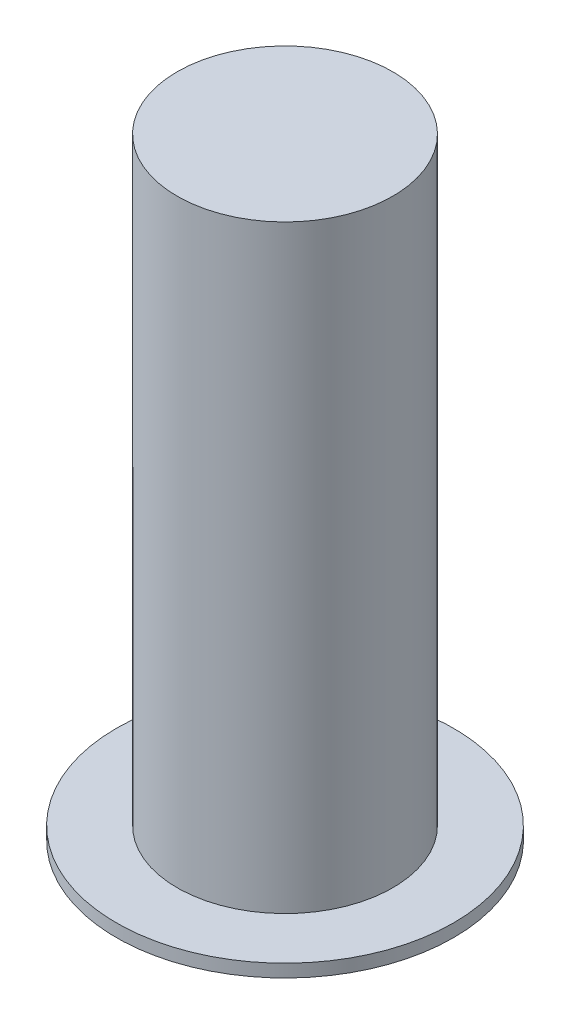
ISO-10303-21;
HEADER;
FILE_DESCRIPTION(('STEP AP214'),'2;1');
FILE_NAME('part.step','',(''),(''),'','','');
FILE_SCHEMA(('AUTOMOTIVE_DESIGN { 1 0 10303 214 1 1 1 1 }'));
ENDSEC;
DATA;
#1=APPLICATION_CONTEXT('core data for automotive mechanical design processes');
#2=APPLICATION_PROTOCOL_DEFINITION('international standard','automotive_design',2000,#1);
#3=PRODUCT_CONTEXT('',#1,'mechanical');
#4=PRODUCT('Part','Part','',(#3));
#5=PRODUCT_RELATED_PRODUCT_CATEGORY('part','',(#4));
#6=PRODUCT_DEFINITION_FORMATION('','',#4);
#7=PRODUCT_DEFINITION_CONTEXT('part definition',#1,'design');
#8=PRODUCT_DEFINITION('design','',#6,#7);
#9=PRODUCT_DEFINITION_SHAPE('','',#8);
#10=(LENGTH_UNIT() NAMED_UNIT(*) SI_UNIT(.MILLI.,.METRE.));
#11=(NAMED_UNIT(*) PLANE_ANGLE_UNIT() SI_UNIT($,.RADIAN.));
#12=(NAMED_UNIT(*) SI_UNIT($,.STERADIAN.) SOLID_ANGLE_UNIT());
#13=UNCERTAINTY_MEASURE_WITH_UNIT(LENGTH_MEASURE(1.E-05),#10,'distance_accuracy_value','');
#14=(GEOMETRIC_REPRESENTATION_CONTEXT(3) GLOBAL_UNCERTAINTY_ASSIGNED_CONTEXT((#13)) GLOBAL_UNIT_ASSIGNED_CONTEXT((#10,
#11,#12)) REPRESENTATION_CONTEXT('',''));
#15=CARTESIAN_POINT('',(0.,0.,0.));
#16=DIRECTION('',(0.,0.,1.));
#17=DIRECTION('',(1.,0.,0.));
#18=AXIS2_PLACEMENT_3D('',#15,#16,#17);
#19=CARTESIAN_POINT('',(0.,30.36,0.));
#20=DIRECTION('',(0.,1.,0.));
#21=DIRECTION('',(-1.,0.,0.));
#22=AXIS2_PLACEMENT_3D('',#19,#20,#21);
#23=CYLINDRICAL_SURFACE('',#22,8.54500000000001);
#24=CARTESIAN_POINT('',(0.,-0.649999999999998,0.));
#25=DIRECTION('',(0.,1.,0.));
#26=DIRECTION('',(-1.,0.,0.));
#27=AXIS2_PLACEMENT_3D('',#24,#25,#26);
#28=CIRCLE('',#27,8.54500000000001);
#29=CARTESIAN_POINT('',(-8.545,-0.65,0.));
#30=VERTEX_POINT('',#29);
#31=EDGE_CURVE('E59',#30,#30,#28,.T.);
#32=ORIENTED_EDGE('',*,*,#31,.T.);
#33=EDGE_LOOP('',(#32));
#34=FACE_BOUND('',#33,.T.);
#35=CARTESIAN_POINT('',(0.,0.,0.));
#36=DIRECTION('',(0.,1.,0.));
#37=DIRECTION('',(-1.,0.,0.));
#38=AXIS2_PLACEMENT_3D('',#35,#36,#37);
#39=CIRCLE('',#38,8.54500000000001);
#40=CARTESIAN_POINT('',(-8.545,0.,0.));
#41=VERTEX_POINT('',#40);
#42=EDGE_CURVE('E10',#41,#41,#39,.T.);
#43=ORIENTED_EDGE('',*,*,#42,.F.);
#44=EDGE_LOOP('',(#43));
#45=FACE_BOUND('',#44,.T.);
#46=ADVANCED_FACE('F37',(#34,#45),#23,.T.);
#47=CARTESIAN_POINT('',(-8.545,0.,0.));
#48=DIRECTION('',(0.,1.,0.));
#49=DIRECTION('',(-1.,0.,0.));
#50=AXIS2_PLACEMENT_3D('',#47,#48,#49);
#51=PLANE('',#50);
#52=ORIENTED_EDGE('',*,*,#42,.T.);
#53=EDGE_LOOP('',(#52));
#54=FACE_BOUND('',#53,.T.);
#55=CARTESIAN_POINT('',(0.,0.,0.));
#56=DIRECTION('',(0.,1.,0.));
#57=DIRECTION('',(-1.,0.,0.));
#58=AXIS2_PLACEMENT_3D('',#55,#56,#57);
#59=CIRCLE('',#58,5.46500000000001);
#60=CARTESIAN_POINT('',(-5.465,0.,0.));
#61=VERTEX_POINT('',#60);
#62=EDGE_CURVE('E43',#61,#61,#59,.T.);
#63=ORIENTED_EDGE('',*,*,#62,.F.);
#64=EDGE_LOOP('',(#63));
#65=FACE_BOUND('',#64,.T.);
#66=ADVANCED_FACE('F77',(#54,#65),#51,.T.);
#67=CARTESIAN_POINT('',(0.,30.36,0.));
#68=DIRECTION('',(0.,1.,0.));
#69=DIRECTION('',(-1.,0.,0.));
#70=AXIS2_PLACEMENT_3D('',#67,#68,#69);
#71=CYLINDRICAL_SURFACE('',#70,5.465);
#72=ORIENTED_EDGE('',*,*,#62,.T.);
#73=EDGE_LOOP('',(#72));
#74=FACE_BOUND('',#73,.T.);
#75=CARTESIAN_POINT('',(0.,30.36,0.));
#76=DIRECTION('',(0.,1.,0.));
#77=DIRECTION('',(-1.,0.,0.));
#78=AXIS2_PLACEMENT_3D('',#75,#76,#77);
#79=CIRCLE('',#78,5.465);
#80=CARTESIAN_POINT('',(-5.465,30.36,0.));
#81=VERTEX_POINT('',#80);
#82=EDGE_CURVE('E47',#81,#81,#79,.T.);
#83=ORIENTED_EDGE('',*,*,#82,.F.);
#84=EDGE_LOOP('',(#83));
#85=FACE_BOUND('',#84,.T.);
#86=ADVANCED_FACE('F81',(#74,#85),#71,.T.);
#87=CARTESIAN_POINT('',(-5.465,30.36,0.));
#88=DIRECTION('',(0.,1.,0.));
#89=DIRECTION('',(-1.,0.,0.));
#90=AXIS2_PLACEMENT_3D('',#87,#88,#89);
#91=PLANE('',#90);
#92=ORIENTED_EDGE('',*,*,#82,.T.);
#93=EDGE_LOOP('',(#92));
#94=FACE_BOUND('',#93,.T.);
#95=ADVANCED_FACE('F85',(#94),#91,.T.);
#96=CARTESIAN_POINT('',(0.,16.55,0.));
#97=DIRECTION('',(0.,-1.,0.));
#98=DIRECTION('',(1.,0.,0.));
#99=AXIS2_PLACEMENT_3D('',#96,#97,#98);
#100=PLANE('',#99);
#101=CARTESIAN_POINT('',(0.,16.55,0.));
#102=DIRECTION('',(0.,1.,0.));
#103=DIRECTION('',(-1.,0.,0.));
#104=AXIS2_PLACEMENT_3D('',#101,#102,#103);
#105=CIRCLE('',#104,5.135);
#106=CARTESIAN_POINT('',(-5.135,16.55,0.));
#107=VERTEX_POINT('',#106);
#108=EDGE_CURVE('E51',#107,#107,#105,.T.);
#109=ORIENTED_EDGE('',*,*,#108,.F.);
#110=EDGE_LOOP('',(#109));
#111=FACE_BOUND('',#110,.T.);
#112=ADVANCED_FACE('F73',(#111),#100,.T.);
#113=CARTESIAN_POINT('',(0.,30.36,0.));
#114=DIRECTION('',(0.,1.,0.));
#115=DIRECTION('',(-1.,0.,0.));
#116=AXIS2_PLACEMENT_3D('',#113,#114,#115);
#117=CYLINDRICAL_SURFACE('',#116,5.13500000000001);
#118=ORIENTED_EDGE('',*,*,#108,.T.);
#119=EDGE_LOOP('',(#118));
#120=FACE_BOUND('',#119,.T.);
#121=CARTESIAN_POINT('',(0.,-0.649999999999998,0.));
#122=DIRECTION('',(0.,1.,0.));
#123=DIRECTION('',(-1.,0.,0.));
#124=AXIS2_PLACEMENT_3D('',#121,#122,#123);
#125=CIRCLE('',#124,5.13500000000001);
#126=CARTESIAN_POINT('',(-5.135,-0.649999999999999,0.));
#127=VERTEX_POINT('',#126);
#128=EDGE_CURVE('E56',#127,#127,#125,.T.);
#129=ORIENTED_EDGE('',*,*,#128,.F.);
#130=EDGE_LOOP('',(#129));
#131=FACE_BOUND('',#130,.T.);
#132=ADVANCED_FACE('F67',(#120,#131),#117,.F.);
#133=CARTESIAN_POINT('',(-5.135,-0.649999999999999,0.));
#134=DIRECTION('',(0.,-1.,0.));
#135=DIRECTION('',(1.,0.,0.));
#136=AXIS2_PLACEMENT_3D('',#133,#134,#135);
#137=PLANE('',#136);
#138=ORIENTED_EDGE('',*,*,#128,.T.);
#139=EDGE_LOOP('',(#138));
#140=FACE_BOUND('',#139,.T.);
#141=ORIENTED_EDGE('',*,*,#31,.F.);
#142=EDGE_LOOP('',(#141));
#143=FACE_BOUND('',#142,.T.);
#144=ADVANCED_FACE('F65',(#140,#143),#137,.T.);
#145=CLOSED_SHELL('',(#46,#66,#86,#95,#112,#132,#144));
#146=MANIFOLD_SOLID_BREP('B2',#145);
#147=ADVANCED_BREP_SHAPE_REPRESENTATION('',(#18,#146),#14);
#148=SHAPE_DEFINITION_REPRESENTATION(#9,#147);
ENDSEC;
END-ISO-10303-21;
